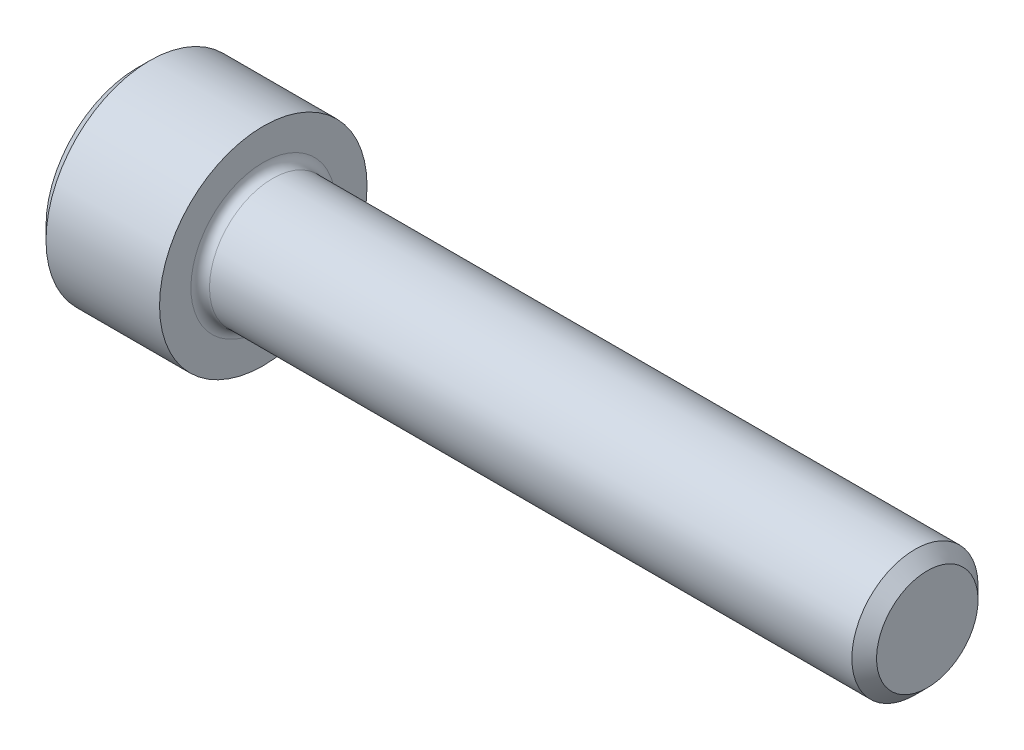
ISO-10303-21;
HEADER;
FILE_DESCRIPTION(('STEP AP214'),'2;1');
FILE_NAME('part.step','',(''),(''),'','','');
FILE_SCHEMA(('AUTOMOTIVE_DESIGN { 1 0 10303 214 1 1 1 1 }'));
ENDSEC;
DATA;
#1=APPLICATION_CONTEXT('core data for automotive mechanical design processes');
#2=APPLICATION_PROTOCOL_DEFINITION('international standard','automotive_design',2000,#1);
#3=PRODUCT_CONTEXT('',#1,'mechanical');
#4=PRODUCT('Part','Part','',(#3));
#5=PRODUCT_RELATED_PRODUCT_CATEGORY('part','',(#4));
#6=PRODUCT_DEFINITION_FORMATION('','',#4);
#7=PRODUCT_DEFINITION_CONTEXT('part definition',#1,'design');
#8=PRODUCT_DEFINITION('design','',#6,#7);
#9=PRODUCT_DEFINITION_SHAPE('','',#8);
#10=(LENGTH_UNIT() NAMED_UNIT(*) SI_UNIT(.MILLI.,.METRE.));
#11=(NAMED_UNIT(*) PLANE_ANGLE_UNIT() SI_UNIT($,.RADIAN.));
#12=(NAMED_UNIT(*) SI_UNIT($,.STERADIAN.) SOLID_ANGLE_UNIT());
#13=UNCERTAINTY_MEASURE_WITH_UNIT(LENGTH_MEASURE(1.E-05),#10,'distance_accuracy_value','');
#14=(GEOMETRIC_REPRESENTATION_CONTEXT(3) GLOBAL_UNCERTAINTY_ASSIGNED_CONTEXT((#13)) GLOBAL_UNIT_ASSIGNED_CONTEXT((#10,
#11,#12)) REPRESENTATION_CONTEXT('',''));
#15=CARTESIAN_POINT('',(0.,0.,0.));
#16=DIRECTION('',(0.,0.,1.));
#17=DIRECTION('',(1.,0.,0.));
#18=AXIS2_PLACEMENT_3D('',#15,#16,#17);
#19=CARTESIAN_POINT('',(2.286,-1.729383501,-1.98501));
#20=DIRECTION('',(-1.,0.,0.));
#21=DIRECTION('',(0.,0.,1.));
#22=AXIS2_PLACEMENT_3D('',#19,#20,#21);
#23=PLANE('',#22);
#24=CARTESIAN_POINT('',(2.286,0.,0.));
#25=DIRECTION('',(-1.,0.,0.));
#26=DIRECTION('',(0.,0.,1.));
#27=AXIS2_PLACEMENT_3D('',#24,#25,#26);
#28=CIRCLE('',#27,1.98501);
#29=CARTESIAN_POINT('',(2.286,-3.81166474394743E-10,-1.98501));
#30=VERTEX_POINT('',#29);
#31=CARTESIAN_POINT('',(2.286,-1.71906908660764,-0.99250500002828));
#32=VERTEX_POINT('',#31);
#33=EDGE_CURVE('E94',#30,#32,#28,.T.);
#34=ORIENTED_EDGE('',*,*,#33,.F.);
#35=DIRECTION('',(0.,-1.,0.));
#36=VECTOR('',#35,1.);
#37=CARTESIAN_POINT('',(2.286,-0.859534543,-1.98501));
#38=LINE('',#37,#36);
#39=CARTESIAN_POINT('',(2.286,-1.14604605767532,-1.98501));
#40=VERTEX_POINT('',#39);
#41=EDGE_CURVE('E90',#30,#40,#38,.T.);
#42=ORIENTED_EDGE('',*,*,#41,.T.);
#43=DIRECTION('',(0.,-0.499999999964279,0.866025403805063));
#44=VECTOR('',#43,1.);
#45=CARTESIAN_POINT('',(2.286,-1.14604605735064,-1.98501));
#46=LINE('',#45,#44);
#47=EDGE_CURVE('E21',#40,#32,#46,.T.);
#48=ORIENTED_EDGE('',*,*,#47,.T.);
#49=EDGE_LOOP('',(#34,#42,#48));
#50=FACE_BOUND('',#49,.T.);
#51=ADVANCED_FACE('F17',(#50),#23,.T.);
#52=CARTESIAN_POINT('',(2.286,-2.295530254,-1.00441506));
#53=DIRECTION('',(-1.,0.,0.));
#54=DIRECTION('',(0.,0.,1.));
#55=AXIS2_PLACEMENT_3D('',#52,#53,#54);
#56=PLANE('',#55);
#57=CARTESIAN_POINT('',(2.286,0.,0.));
#58=DIRECTION('',(-1.,0.,0.));
#59=DIRECTION('',(0.,0.,1.));
#60=AXIS2_PLACEMENT_3D('',#57,#58,#59);
#61=CIRCLE('',#60,1.98501);
#62=CARTESIAN_POINT('',(2.286,-1.71906908685505,0.992504999599751));
#63=VERTEX_POINT('',#62);
#64=EDGE_CURVE('E122',#32,#63,#61,.T.);
#65=ORIENTED_EDGE('',*,*,#64,.F.);
#66=DIRECTION('',(0.,-0.499999999825974,0.866025403884913));
#67=VECTOR('',#66,1.);
#68=CARTESIAN_POINT('',(2.286,-1.71906908731405,-0.992504999507718));
#69=LINE('',#68,#67);
#70=CARTESIAN_POINT('',(2.286,-2.29209211578409,3.39962631627323E-11));
#71=VERTEX_POINT('',#70);
#72=EDGE_CURVE('E114',#32,#71,#69,.T.);
#73=ORIENTED_EDGE('',*,*,#72,.T.);
#74=DIRECTION('',(0.,0.499999999825974,0.866025403884913));
#75=VECTOR('',#74,1.);
#76=CARTESIAN_POINT('',(2.286,-2.29209211568595,0.));
#77=LINE('',#76,#75);
#78=EDGE_CURVE('E98',#71,#63,#77,.T.);
#79=ORIENTED_EDGE('',*,*,#78,.T.);
#80=EDGE_LOOP('',(#65,#73,#79));
#81=FACE_BOUND('',#80,.T.);
#82=ADVANCED_FACE('F123',(#81),#56,.T.);
#83=CARTESIAN_POINT('',(2.286,-1.729383501,0.98654997));
#84=DIRECTION('',(-1.,0.,0.));
#85=DIRECTION('',(0.,0.,1.));
#86=AXIS2_PLACEMENT_3D('',#83,#84,#85);
#87=PLANE('',#86);
#88=CARTESIAN_POINT('',(2.286,0.,0.));
#89=DIRECTION('',(-1.,0.,0.));
#90=DIRECTION('',(0.,0.,1.));
#91=AXIS2_PLACEMENT_3D('',#88,#89,#90);
#92=CIRCLE('',#91,1.98501);
#93=CARTESIAN_POINT('',(2.286,-1.52275368124845E-10,1.98501));
#94=VERTEX_POINT('',#93);
#95=EDGE_CURVE('E127',#63,#94,#92,.T.);
#96=ORIENTED_EDGE('',*,*,#95,.F.);
#97=DIRECTION('',(0.,0.499999999964279,0.866025403805063));
#98=VECTOR('',#97,1.);
#99=CARTESIAN_POINT('',(2.286,-1.71906908605193,0.992505000287827));
#100=LINE('',#99,#98);
#101=CARTESIAN_POINT('',(2.286,-1.14604605767532,1.98501));
#102=VERTEX_POINT('',#101);
#103=EDGE_CURVE('E131',#63,#102,#100,.T.);
#104=ORIENTED_EDGE('',*,*,#103,.T.);
#105=DIRECTION('',(0.,1.,0.));
#106=VECTOR('',#105,1.);
#107=CARTESIAN_POINT('',(2.286,-0.859534543,1.98501));
#108=LINE('',#107,#106);
#109=EDGE_CURVE('E119',#102,#94,#108,.T.);
#110=ORIENTED_EDGE('',*,*,#109,.T.);
#111=EDGE_LOOP('',(#96,#104,#110));
#112=FACE_BOUND('',#111,.T.);
#113=ADVANCED_FACE('F208',(#112),#87,.T.);
#114=CARTESIAN_POINT('',(2.286,-0.010314415,0.98654997));
#115=DIRECTION('',(-1.,0.,0.));
#116=DIRECTION('',(0.,0.,1.));
#117=AXIS2_PLACEMENT_3D('',#114,#115,#116);
#118=PLANE('',#117);
#119=CARTESIAN_POINT('',(2.286,0.,0.));
#120=DIRECTION('',(-1.,0.,0.));
#121=DIRECTION('',(0.,0.,1.));
#122=AXIS2_PLACEMENT_3D('',#119,#120,#121);
#123=CIRCLE('',#122,1.98501);
#124=CARTESIAN_POINT('',(2.286,1.71906908660764,0.992505000028279));
#125=VERTEX_POINT('',#124);
#126=EDGE_CURVE('E294',#94,#125,#123,.T.);
#127=ORIENTED_EDGE('',*,*,#126,.F.);
#128=DIRECTION('',(0.,1.,0.));
#129=VECTOR('',#128,1.);
#130=CARTESIAN_POINT('',(2.286,0.859534543,1.98501));
#131=LINE('',#130,#129);
#132=CARTESIAN_POINT('',(2.286,1.14604605767532,1.98501));
#133=VERTEX_POINT('',#132);
#134=EDGE_CURVE('E269',#94,#133,#131,.T.);
#135=ORIENTED_EDGE('',*,*,#134,.T.);
#136=DIRECTION('',(0.,0.499999999964278,-0.866025403805063));
#137=VECTOR('',#136,1.);
#138=CARTESIAN_POINT('',(2.286,1.14604605735064,1.98501));
#139=LINE('',#138,#137);
#140=EDGE_CURVE('E129',#133,#125,#139,.T.);
#141=ORIENTED_EDGE('',*,*,#140,.T.);
#142=EDGE_LOOP('',(#127,#135,#141));
#143=FACE_BOUND('',#142,.T.);
#144=ADVANCED_FACE('F204',(#143),#118,.T.);
#145=CARTESIAN_POINT('',(2.286,1.715630949,-1.00441506));
#146=DIRECTION('',(-1.,0.,0.));
#147=DIRECTION('',(0.,0.,1.));
#148=AXIS2_PLACEMENT_3D('',#145,#146,#147);
#149=PLANE('',#148);
#150=CARTESIAN_POINT('',(2.286,0.,0.));
#151=DIRECTION('',(-1.,0.,0.));
#152=DIRECTION('',(0.,0.,1.));
#153=AXIS2_PLACEMENT_3D('',#150,#151,#152);
#154=CIRCLE('',#153,1.98501);
#155=CARTESIAN_POINT('',(2.286,1.71906908701974,-0.992504999763296));
#156=VERTEX_POINT('',#155);
#157=EDGE_CURVE('E255',#125,#156,#154,.T.);
#158=ORIENTED_EDGE('',*,*,#157,.F.);
#159=DIRECTION('',(0.,0.499999999825974,-0.866025403884913));
#160=VECTOR('',#159,1.);
#161=CARTESIAN_POINT('',(2.286,1.71906908731405,0.992504999507718));
#162=LINE('',#161,#160);
#163=CARTESIAN_POINT('',(2.286,2.29209211578409,-3.39963652931999E-11));
#164=VERTEX_POINT('',#163);
#165=EDGE_CURVE('E297',#125,#164,#162,.T.);
#166=ORIENTED_EDGE('',*,*,#165,.T.);
#167=DIRECTION('',(0.,-0.499999999825974,-0.866025403884913));
#168=VECTOR('',#167,1.);
#169=CARTESIAN_POINT('',(2.286,2.29209211568595,0.));
#170=LINE('',#169,#168);
#171=EDGE_CURVE('E270',#164,#156,#170,.T.);
#172=ORIENTED_EDGE('',*,*,#171,.T.);
#173=EDGE_LOOP('',(#158,#166,#172));
#174=FACE_BOUND('',#173,.T.);
#175=ADVANCED_FACE('F201',(#174),#149,.T.);
#176=CARTESIAN_POINT('',(3.432046058,0.,0.));
#177=DIRECTION('',(-1.,0.,0.));
#178=DIRECTION('',(0.,0.,1.));
#179=AXIS2_PLACEMENT_3D('',#176,#177,#178);
#180=CONICAL_SURFACE('',#179,0.,1.04719755113769);
#181=CARTESIAN_POINT('',(3.432046058,0.,0.));
#182=VERTEX_POINT('',#181);
#183=VERTEX_LOOP('',#182);
#184=FACE_BOUND('',#183,.T.);
#185=ORIENTED_EDGE('',*,*,#157,.T.);
#186=CARTESIAN_POINT('',(2.286,0.,0.));
#187=DIRECTION('',(-1.,0.,0.));
#188=DIRECTION('',(0.,0.,1.));
#189=AXIS2_PLACEMENT_3D('',#186,#187,#188);
#190=CIRCLE('',#189,1.98501);
#191=EDGE_CURVE('E254',#30,#156,#190,.F.);
#192=ORIENTED_EDGE('',*,*,#191,.F.);
#193=ORIENTED_EDGE('',*,*,#33,.T.);
#194=ORIENTED_EDGE('',*,*,#64,.T.);
#195=ORIENTED_EDGE('',*,*,#95,.T.);
#196=ORIENTED_EDGE('',*,*,#126,.T.);
#197=EDGE_LOOP('',(#185,#192,#193,#194,#195,#196));
#198=FACE_BOUND('',#197,.T.);
#199=ADVANCED_FACE('F199',(#184,#198),#180,.F.);
#200=CARTESIAN_POINT('',(2.286,-0.010314415,-1.98501));
#201=DIRECTION('',(-1.,0.,0.));
#202=DIRECTION('',(0.,0.,1.));
#203=AXIS2_PLACEMENT_3D('',#200,#201,#202);
#204=PLANE('',#203);
#205=ORIENTED_EDGE('',*,*,#191,.T.);
#206=DIRECTION('',(0.,-0.500000000051013,-0.866025403754986));
#207=VECTOR('',#206,1.);
#208=CARTESIAN_POINT('',(2.286,1.719069087,-0.992505));
#209=LINE('',#208,#207);
#210=CARTESIAN_POINT('',(2.286,1.14604605778355,-1.98501));
#211=VERTEX_POINT('',#210);
#212=EDGE_CURVE('E258',#156,#211,#209,.T.);
#213=ORIENTED_EDGE('',*,*,#212,.T.);
#214=DIRECTION('',(0.,-1.,0.));
#215=VECTOR('',#214,1.);
#216=CARTESIAN_POINT('',(2.286,0.859534543,-1.98501));
#217=LINE('',#216,#215);
#218=EDGE_CURVE('E252',#211,#30,#217,.T.);
#219=ORIENTED_EDGE('',*,*,#218,.T.);
#220=EDGE_LOOP('',(#205,#213,#219));
#221=FACE_BOUND('',#220,.T.);
#222=ADVANCED_FACE('F195',(#221),#204,.T.);
#223=CARTESIAN_POINT('',(0.,1.146046058,-1.98501));
#224=DIRECTION('',(0.,0.866025403754987,-0.500000000051013));
#225=DIRECTION('',(0.,0.500000000051013,0.866025403754987));
#226=AXIS2_PLACEMENT_3D('',#223,#224,#225);
#227=PLANE('',#226);
#228=ORIENTED_EDGE('',*,*,#171,.F.);
#229=DIRECTION('',(1.,0.,0.));
#230=VECTOR('',#229,1.);
#231=CARTESIAN_POINT('',(1.143,2.292092116,0.));
#232=LINE('',#231,#230);
#233=CARTESIAN_POINT('',(0.,2.29209211796823,-3.09916046818681E-10));
#234=VERTEX_POINT('',#233);
#235=EDGE_CURVE('E261',#234,#164,#232,.T.);
#236=ORIENTED_EDGE('',*,*,#235,.F.);
#237=DIRECTION('',(0.,0.500000001278527,0.866025403046281));
#238=VECTOR('',#237,1.);
#239=CARTESIAN_POINT('',(0.,1.14604605590346,-1.9850100020923));
#240=LINE('',#239,#238);
#241=CARTESIAN_POINT('',(0.,1.14604605678512,-1.98501000094996));
#242=VERTEX_POINT('',#241);
#243=EDGE_CURVE('E266',#242,#234,#240,.T.);
#244=ORIENTED_EDGE('',*,*,#243,.F.);
#245=DIRECTION('',(1.,0.,0.));
#246=VECTOR('',#245,1.);
#247=CARTESIAN_POINT('',(1.143,1.146046058,-1.98501));
#248=LINE('',#247,#246);
#249=EDGE_CURVE('E108',#242,#211,#248,.T.);
#250=ORIENTED_EDGE('',*,*,#249,.T.);
#251=ORIENTED_EDGE('',*,*,#212,.F.);
#252=EDGE_LOOP('',(#228,#236,#244,#250,#251));
#253=FACE_BOUND('',#252,.T.);
#254=ADVANCED_FACE('F191',(#253),#227,.F.);
#255=CARTESIAN_POINT('',(0.,1.146046058,1.98501));
#256=DIRECTION('',(0.,-0.866025403754987,-0.500000000051013));
#257=DIRECTION('',(0.,0.500000000051013,-0.866025403754987));
#258=AXIS2_PLACEMENT_3D('',#255,#256,#257);
#259=PLANE('',#258);
#260=ORIENTED_EDGE('',*,*,#165,.F.);
#261=ORIENTED_EDGE('',*,*,#140,.F.);
#262=DIRECTION('',(-1.,0.,0.));
#263=VECTOR('',#262,1.);
#264=CARTESIAN_POINT('',(1.143,1.146046058,1.98501));
#265=LINE('',#264,#263);
#266=CARTESIAN_POINT('',(0.,1.14604605678512,1.98501000094996));
#267=VERTEX_POINT('',#266);
#268=EDGE_CURVE('E141',#133,#267,#265,.T.);
#269=ORIENTED_EDGE('',*,*,#268,.T.);
#270=DIRECTION('',(0.,-0.500000001278527,0.866025403046281));
#271=VECTOR('',#270,1.);
#272=CARTESIAN_POINT('',(0.,2.29209211886288,0.));
#273=LINE('',#272,#271);
#274=EDGE_CURVE('E153',#234,#267,#273,.T.);
#275=ORIENTED_EDGE('',*,*,#274,.F.);
#276=ORIENTED_EDGE('',*,*,#235,.T.);
#277=EDGE_LOOP('',(#260,#261,#269,#275,#276));
#278=FACE_BOUND('',#277,.T.);
#279=ADVANCED_FACE('F187',(#278),#259,.T.);
#280=CARTESIAN_POINT('',(0.,1.146046058,1.98501));
#281=DIRECTION('',(0.,0.,1.));
#282=DIRECTION('',(0.,-1.,0.));
#283=AXIS2_PLACEMENT_3D('',#280,#281,#282);
#284=PLANE('',#283);
#285=ORIENTED_EDGE('',*,*,#109,.F.);
#286=DIRECTION('',(1.,0.,0.));
#287=VECTOR('',#286,1.);
#288=CARTESIAN_POINT('',(1.143,-1.146046058,1.98501));
#289=LINE('',#288,#287);
#290=CARTESIAN_POINT('',(0.,-1.14604605678512,1.98501000094996));
#291=VERTEX_POINT('',#290);
#292=EDGE_CURVE('E144',#291,#102,#289,.T.);
#293=ORIENTED_EDGE('',*,*,#292,.F.);
#294=DIRECTION('',(0.,-1.,0.));
#295=VECTOR('',#294,1.);
#296=CARTESIAN_POINT('',(0.,0.,1.9850100020923));
#297=LINE('',#296,#295);
#298=EDGE_CURVE('E150',#267,#291,#297,.T.);
#299=ORIENTED_EDGE('',*,*,#298,.F.);
#300=ORIENTED_EDGE('',*,*,#268,.F.);
#301=ORIENTED_EDGE('',*,*,#134,.F.);
#302=EDGE_LOOP('',(#285,#293,#299,#300,#301));
#303=FACE_BOUND('',#302,.T.);
#304=ADVANCED_FACE('F183',(#303),#284,.F.);
#305=CARTESIAN_POINT('',(0.,-2.292092116,0.));
#306=DIRECTION('',(0.,0.866025403754987,-0.500000000051013));
#307=DIRECTION('',(0.,0.500000000051013,0.866025403754987));
#308=AXIS2_PLACEMENT_3D('',#305,#306,#307);
#309=PLANE('',#308);
#310=ORIENTED_EDGE('',*,*,#103,.F.);
#311=ORIENTED_EDGE('',*,*,#78,.F.);
#312=DIRECTION('',(1.,0.,0.));
#313=VECTOR('',#312,1.);
#314=CARTESIAN_POINT('',(1.143,-2.292092116,0.));
#315=LINE('',#314,#313);
#316=CARTESIAN_POINT('',(0.,-2.29209211796823,-3.09915573733553E-10));
#317=VERTEX_POINT('',#316);
#318=EDGE_CURVE('E109',#317,#71,#315,.T.);
#319=ORIENTED_EDGE('',*,*,#318,.F.);
#320=DIRECTION('',(0.,-0.500000001278527,-0.866025403046281));
#321=VECTOR('',#320,1.);
#322=CARTESIAN_POINT('',(0.,-1.14604605590346,1.9850100020923));
#323=LINE('',#322,#321);
#324=EDGE_CURVE('E152',#291,#317,#323,.T.);
#325=ORIENTED_EDGE('',*,*,#324,.F.);
#326=ORIENTED_EDGE('',*,*,#292,.T.);
#327=EDGE_LOOP('',(#310,#311,#319,#325,#326));
#328=FACE_BOUND('',#327,.T.);
#329=ADVANCED_FACE('F180',(#328),#309,.T.);
#330=CARTESIAN_POINT('',(0.,-1.146046058,-1.98501));
#331=DIRECTION('',(0.,0.866025403754987,0.500000000051013));
#332=DIRECTION('',(0.,-0.500000000051013,0.866025403754987));
#333=AXIS2_PLACEMENT_3D('',#330,#331,#332);
#334=PLANE('',#333);
#335=ORIENTED_EDGE('',*,*,#72,.F.);
#336=ORIENTED_EDGE('',*,*,#47,.F.);
#337=DIRECTION('',(-1.,0.,0.));
#338=VECTOR('',#337,1.);
#339=CARTESIAN_POINT('',(1.143,-1.146046058,-1.98501));
#340=LINE('',#339,#338);
#341=CARTESIAN_POINT('',(0.,-1.14604605678512,-1.98501000094996));
#342=VERTEX_POINT('',#341);
#343=EDGE_CURVE('E102',#40,#342,#340,.T.);
#344=ORIENTED_EDGE('',*,*,#343,.T.);
#345=DIRECTION('',(0.,0.500000001278527,-0.866025403046281));
#346=VECTOR('',#345,1.);
#347=CARTESIAN_POINT('',(0.,-2.29209211886288,0.));
#348=LINE('',#347,#346);
#349=EDGE_CURVE('E149',#317,#342,#348,.T.);
#350=ORIENTED_EDGE('',*,*,#349,.F.);
#351=ORIENTED_EDGE('',*,*,#318,.T.);
#352=EDGE_LOOP('',(#335,#336,#344,#350,#351));
#353=FACE_BOUND('',#352,.T.);
#354=ADVANCED_FACE('F112',(#353),#334,.T.);
#355=CARTESIAN_POINT('',(0.,-1.146046058,-1.98501));
#356=DIRECTION('',(0.,0.,-1.));
#357=DIRECTION('',(0.,1.,0.));
#358=AXIS2_PLACEMENT_3D('',#355,#356,#357);
#359=PLANE('',#358);
#360=ORIENTED_EDGE('',*,*,#218,.F.);
#361=ORIENTED_EDGE('',*,*,#249,.F.);
#362=DIRECTION('',(0.,1.,0.));
#363=VECTOR('',#362,1.);
#364=CARTESIAN_POINT('',(0.,0.,-1.9850100020923));
#365=LINE('',#364,#363);
#366=EDGE_CURVE('E105',#342,#242,#365,.T.);
#367=ORIENTED_EDGE('',*,*,#366,.F.);
#368=ORIENTED_EDGE('',*,*,#343,.F.);
#369=ORIENTED_EDGE('',*,*,#41,.F.);
#370=EDGE_LOOP('',(#360,#361,#367,#368,#369));
#371=FACE_BOUND('',#370,.T.);
#372=ADVANCED_FACE('F103',(#371),#359,.F.);
#373=CARTESIAN_POINT('',(0.,-3.5279838,-3.5279838));
#374=DIRECTION('',(-1.,0.,0.));
#375=DIRECTION('',(0.,0.,1.));
#376=AXIS2_PLACEMENT_3D('',#373,#374,#375);
#377=PLANE('',#376);
#378=ORIENTED_EDGE('',*,*,#349,.T.);
#379=ORIENTED_EDGE('',*,*,#366,.T.);
#380=ORIENTED_EDGE('',*,*,#243,.T.);
#381=ORIENTED_EDGE('',*,*,#274,.T.);
#382=ORIENTED_EDGE('',*,*,#298,.T.);
#383=ORIENTED_EDGE('',*,*,#324,.T.);
#384=EDGE_LOOP('',(#378,#379,#380,#381,#382,#383));
#385=FACE_BOUND('',#384,.T.);
#386=CARTESIAN_POINT('',(0.,0.,0.));
#387=DIRECTION('',(1.,0.,0.));
#388=DIRECTION('',(0.,0.,-1.));
#389=AXIS2_PLACEMENT_3D('',#386,#387,#388);
#390=CIRCLE('',#389,3.48615);
#391=CARTESIAN_POINT('',(0.,0.,-3.48615));
#392=VERTEX_POINT('',#391);
#393=EDGE_CURVE('E148',#392,#392,#390,.F.);
#394=ORIENTED_EDGE('',*,*,#393,.T.);
#395=EDGE_LOOP('',(#394));
#396=FACE_BOUND('',#395,.T.);
#397=ADVANCED_FACE('F171',(#385,#396),#377,.T.);
#398=CARTESIAN_POINT('',(30.226,-1.96384672,1.96384672));
#399=DIRECTION('',(1.,0.,0.));
#400=DIRECTION('',(0.,0.,-1.));
#401=AXIS2_PLACEMENT_3D('',#398,#399,#400);
#402=PLANE('',#401);
#403=CARTESIAN_POINT('',(30.226,0.,0.));
#404=DIRECTION('',(-1.,0.,0.));
#405=DIRECTION('',(0.,-1.,0.));
#406=AXIS2_PLACEMENT_3D('',#403,#404,#405);
#407=CIRCLE('',#406,1.94056000000002);
#408=CARTESIAN_POINT('',(30.226,-1.94056000000002,0.));
#409=VERTEX_POINT('',#408);
#410=EDGE_CURVE('E249',#409,#409,#407,.F.);
#411=ORIENTED_EDGE('',*,*,#410,.T.);
#412=EDGE_LOOP('',(#411));
#413=FACE_BOUND('',#412,.T.);
#414=ADVANCED_FACE('F167',(#413),#402,.T.);
#415=CARTESIAN_POINT('',(0.,0.,0.));
#416=DIRECTION('',(1.,0.,0.));
#417=DIRECTION('',(0.,0.,-1.));
#418=AXIS2_PLACEMENT_3D('',#415,#416,#417);
#419=CONICAL_SURFACE('',#418,3.48615,0.785398163397448);
#420=CARTESIAN_POINT('',(0.4826,0.,0.));
#421=DIRECTION('',(-1.,0.,0.));
#422=DIRECTION('',(0.,0.,1.));
#423=AXIS2_PLACEMENT_3D('',#420,#421,#422);
#424=CIRCLE('',#423,3.96875);
#425=CARTESIAN_POINT('',(0.4826,0.,3.96875));
#426=VERTEX_POINT('',#425);
#427=EDGE_CURVE('E245',#426,#426,#424,.T.);
#428=ORIENTED_EDGE('',*,*,#427,.T.);
#429=EDGE_LOOP('',(#428));
#430=FACE_BOUND('',#429,.T.);
#431=ORIENTED_EDGE('',*,*,#393,.F.);
#432=EDGE_LOOP('',(#431));
#433=FACE_BOUND('',#432,.T.);
#434=ADVANCED_FACE('F170',(#430,#433),#419,.T.);
#435=CARTESIAN_POINT('',(30.226,0.,0.));
#436=DIRECTION('',(-1.,0.,0.));
#437=DIRECTION('',(0.,-1.,0.));
#438=AXIS2_PLACEMENT_3D('',#435,#436,#437);
#439=CONICAL_SURFACE('',#438,1.94056,0.785398163397451);
#440=ORIENTED_EDGE('',*,*,#410,.F.);
#441=EDGE_LOOP('',(#440));
#442=FACE_BOUND('',#441,.T.);
#443=CARTESIAN_POINT('',(29.75356,0.,0.));
#444=DIRECTION('',(-1.,0.,0.));
#445=DIRECTION('',(0.,0.,1.));
#446=AXIS2_PLACEMENT_3D('',#443,#444,#445);
#447=CIRCLE('',#446,2.413);
#448=CARTESIAN_POINT('',(29.75356,0.,2.413));
#449=VERTEX_POINT('',#448);
#450=EDGE_CURVE('E248',#449,#449,#447,.F.);
#451=ORIENTED_EDGE('',*,*,#450,.T.);
#452=EDGE_LOOP('',(#451));
#453=FACE_BOUND('',#452,.T.);
#454=ADVANCED_FACE('F221',(#442,#453),#439,.T.);
#455=CARTESIAN_POINT('',(4.826,0.,0.));
#456=DIRECTION('',(-1.,0.,0.));
#457=DIRECTION('',(0.,0.,1.));
#458=AXIS2_PLACEMENT_3D('',#455,#456,#457);
#459=CYLINDRICAL_SURFACE('',#458,3.96875);
#460=ORIENTED_EDGE('',*,*,#427,.F.);
#461=EDGE_LOOP('',(#460));
#462=FACE_BOUND('',#461,.T.);
#463=CARTESIAN_POINT('',(4.826,0.,0.));
#464=DIRECTION('',(-1.,0.,0.));
#465=DIRECTION('',(0.,0.,1.));
#466=AXIS2_PLACEMENT_3D('',#463,#464,#465);
#467=CIRCLE('',#466,3.96875);
#468=CARTESIAN_POINT('',(4.826,0.,3.96875));
#469=VERTEX_POINT('',#468);
#470=EDGE_CURVE('E155',#469,#469,#467,.F.);
#471=ORIENTED_EDGE('',*,*,#470,.F.);
#472=EDGE_LOOP('',(#471));
#473=FACE_BOUND('',#472,.T.);
#474=ADVANCED_FACE('F225',(#462,#473),#459,.T.);
#475=CARTESIAN_POINT('',(29.75356,0.,0.));
#476=DIRECTION('',(-1.,0.,0.));
#477=DIRECTION('',(0.,0.,1.));
#478=AXIS2_PLACEMENT_3D('',#475,#476,#477);
#479=CYLINDRICAL_SURFACE('',#478,2.413);
#480=CARTESIAN_POINT('',(5.1816,0.,0.));
#481=DIRECTION('',(1.,0.,0.));
#482=DIRECTION('',(0.,0.,-1.));
#483=AXIS2_PLACEMENT_3D('',#480,#481,#482);
#484=CIRCLE('',#483,2.413);
#485=CARTESIAN_POINT('',(5.1816,0.,-2.413));
#486=VERTEX_POINT('',#485);
#487=EDGE_CURVE('E27',#486,#486,#484,.T.);
#488=ORIENTED_EDGE('',*,*,#487,.T.);
#489=EDGE_LOOP('',(#488));
#490=FACE_BOUND('',#489,.T.);
#491=ORIENTED_EDGE('',*,*,#450,.F.);
#492=EDGE_LOOP('',(#491));
#493=FACE_BOUND('',#492,.T.);
#494=ADVANCED_FACE('F166',(#490,#493),#479,.T.);
#495=CARTESIAN_POINT('',(4.826,-4.016375,4.016375));
#496=DIRECTION('',(1.,0.,0.));
#497=DIRECTION('',(0.,0.,-1.));
#498=AXIS2_PLACEMENT_3D('',#495,#496,#497);
#499=PLANE('',#498);
#500=CARTESIAN_POINT('',(4.826,0.,0.));
#501=DIRECTION('',(1.,0.,0.));
#502=DIRECTION('',(0.,0.,-1.));
#503=AXIS2_PLACEMENT_3D('',#500,#501,#502);
#504=CIRCLE('',#503,2.7686);
#505=CARTESIAN_POINT('',(4.826,0.,2.768600001524));
#506=VERTEX_POINT('',#505);
#507=CARTESIAN_POINT('',(4.826,0.,-2.768600001524));
#508=VERTEX_POINT('',#507);
#509=EDGE_CURVE('E11',#506,#508,#504,.F.);
#510=ORIENTED_EDGE('',*,*,#509,.T.);
#511=CARTESIAN_POINT('',(4.826,0.,-2.768600003048));
#512=CARTESIAN_POINT('',(4.826,-0.272209104737648,-2.76881124350991));
#513=CARTESIAN_POINT('',(4.826,-0.539744919094124,-2.71567038380701));
#514=CARTESIAN_POINT('',(4.826,-0.805094460607816,-2.66296378528403));
#515=CARTESIAN_POINT('',(4.826,-1.05861469836475,-2.55823677080734));
#516=CARTESIAN_POINT('',(4.826,-1.56670470538638,-2.34834918947811));
#517=CARTESIAN_POINT('',(4.826,-1.957688235492,-1.9576994652765));
#518=CARTESIAN_POINT('',(4.826,-2.34646170601122,-1.56925791380192));
#519=CARTESIAN_POINT('',(4.826,-2.5578492557035,-1.0594937470865));
#520=CARTESIAN_POINT('',(4.826,-2.76837785610197,-0.551800949151541));
#521=CARTESIAN_POINT('',(4.826,-2.76859467733475,1.24507625043346E-06));
#522=CARTESIAN_POINT('',(4.826,-2.76881064277924,0.549625489059828));
#523=CARTESIAN_POINT('',(4.826,-2.55785170569225,1.0594876421965));
#524=CARTESIAN_POINT('',(4.826,-2.34769323608875,1.56741516255448));
#525=CARTESIAN_POINT('',(4.826,-1.95770241329575,1.9576844279685));
#526=CARTESIAN_POINT('',(4.826,-1.56892193109583,2.34674248863985));
#527=CARTESIAN_POINT('',(4.826,-1.05950839078975,2.557845319656));
#528=CARTESIAN_POINT('',(4.826,-0.553454896209368,2.7675557354556));
#529=CARTESIAN_POINT('',(4.826,0.,2.768600003048));
#530=B_SPLINE_CURVE_WITH_KNOTS('',2,(#511,#512,#513,#514,#515,#516,#517,#518,#519,#520,#521,
#522,#523,#524,#525,#526,#527,#528,#529),.UNSPECIFIED.,.F.,.F.,(3,2,2,2,2,2,2,2,2,3),(0.,0.0625,
0.125,0.25,0.375,0.5,0.625,0.75,0.875,1.),.UNSPECIFIED.);
#531=EDGE_CURVE('E34',#508,#506,#530,.T.);
#532=ORIENTED_EDGE('',*,*,#531,.T.);
#533=EDGE_LOOP('',(#510,#532));
#534=FACE_BOUND('',#533,.T.);
#535=ORIENTED_EDGE('',*,*,#470,.T.);
#536=EDGE_LOOP('',(#535));
#537=FACE_BOUND('',#536,.T.);
#538=ADVANCED_FACE('F157',(#534,#537),#499,.T.);
#539=CARTESIAN_POINT('',(5.1816,0.,0.));
#540=DIRECTION('',(1.,0.,0.));
#541=DIRECTION('',(0.,0.,-1.));
#542=AXIS2_PLACEMENT_3D('',#539,#540,#541);
#543=TOROIDAL_SURFACE('',#542,2.7686,0.355600000000001);
#544=ORIENTED_EDGE('',*,*,#531,.F.);
#545=ORIENTED_EDGE('',*,*,#509,.F.);
#546=EDGE_LOOP('',(#544,#545));
#547=FACE_BOUND('',#546,.T.);
#548=ORIENTED_EDGE('',*,*,#487,.F.);
#549=EDGE_LOOP('',(#548));
#550=FACE_BOUND('',#549,.T.);
#551=ADVANCED_FACE('F19',(#547,#550),#543,.F.);
#552=CLOSED_SHELL('',(#51,#82,#113,#144,#175,#199,#222,#254,#279,#304,#329,#354,#372,#397,#414,
#434,#454,#474,#494,#538,#551));
#553=MANIFOLD_SOLID_BREP('B1',#552);
#554=ADVANCED_BREP_SHAPE_REPRESENTATION('',(#18,#553),#14);
#555=SHAPE_DEFINITION_REPRESENTATION(#9,#554);
ENDSEC;
END-ISO-10303-21;
